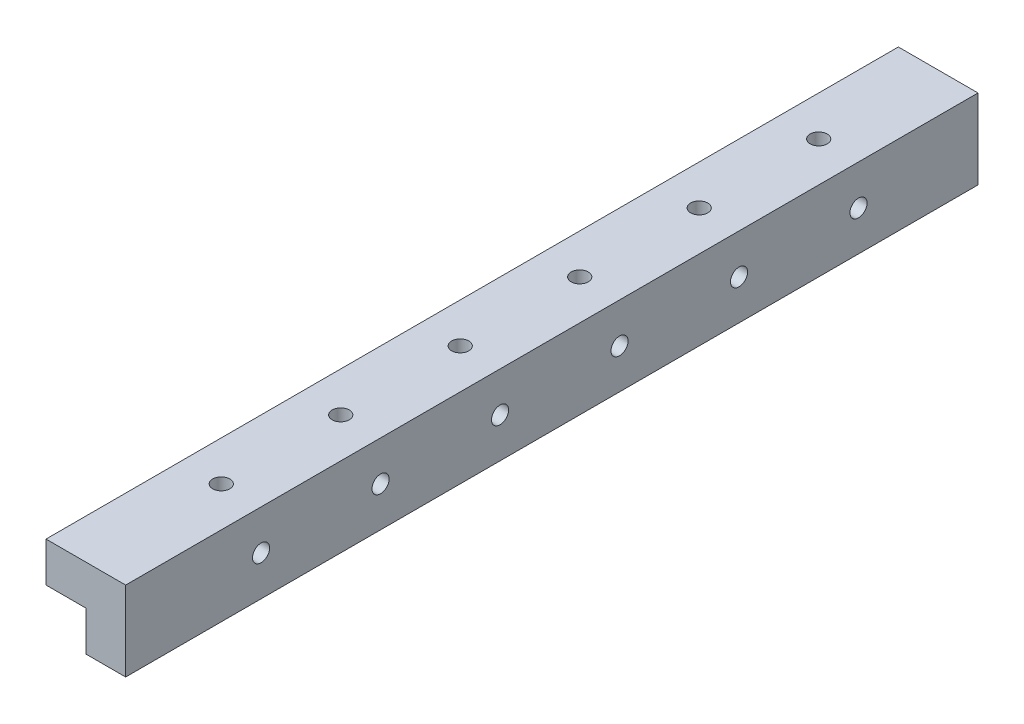
ISO-10303-21;
HEADER;
FILE_DESCRIPTION(('STEP AP214'),'2;1');
FILE_NAME('part.step','',(''),(''),'','','');
FILE_SCHEMA(('AUTOMOTIVE_DESIGN { 1 0 10303 214 1 1 1 1 }'));
ENDSEC;
DATA;
#1=APPLICATION_CONTEXT('core data for automotive mechanical design processes');
#2=APPLICATION_PROTOCOL_DEFINITION('international standard','automotive_design',2000,#1);
#3=PRODUCT_CONTEXT('',#1,'mechanical');
#4=PRODUCT('Part','Part','',(#3));
#5=PRODUCT_RELATED_PRODUCT_CATEGORY('part','',(#4));
#6=PRODUCT_DEFINITION_FORMATION('','',#4);
#7=PRODUCT_DEFINITION_CONTEXT('part definition',#1,'design');
#8=PRODUCT_DEFINITION('design','',#6,#7);
#9=PRODUCT_DEFINITION_SHAPE('','',#8);
#10=(LENGTH_UNIT() NAMED_UNIT(*) SI_UNIT(.MILLI.,.METRE.));
#11=(NAMED_UNIT(*) PLANE_ANGLE_UNIT() SI_UNIT($,.RADIAN.));
#12=(NAMED_UNIT(*) SI_UNIT($,.STERADIAN.) SOLID_ANGLE_UNIT());
#13=UNCERTAINTY_MEASURE_WITH_UNIT(LENGTH_MEASURE(1.E-05),#10,'distance_accuracy_value','');
#14=(GEOMETRIC_REPRESENTATION_CONTEXT(3) GLOBAL_UNCERTAINTY_ASSIGNED_CONTEXT((#13)) GLOBAL_UNIT_ASSIGNED_CONTEXT((#10,
#11,#12)) REPRESENTATION_CONTEXT('',''));
#15=CARTESIAN_POINT('',(0.,0.,0.));
#16=DIRECTION('',(0.,0.,1.));
#17=DIRECTION('',(1.,0.,0.));
#18=AXIS2_PLACEMENT_3D('',#15,#16,#17);
#19=CARTESIAN_POINT('',(0.,0.,-214.));
#20=DIRECTION('',(-1.,0.,0.));
#21=DIRECTION('',(0.,-1.,0.));
#22=AXIS2_PLACEMENT_3D('',#19,#20,#21);
#23=PLANE('',#22);
#24=DIRECTION('',(0.,-1.,0.));
#25=VECTOR('',#24,1.);
#26=CARTESIAN_POINT('',(0.,0.,0.));
#27=LINE('',#26,#25);
#28=CARTESIAN_POINT('',(0.,0.,0.));
#29=VERTEX_POINT('',#28);
#30=CARTESIAN_POINT('',(0.,-10.0000000000002,0.));
#31=VERTEX_POINT('',#30);
#32=EDGE_CURVE('E117',#29,#31,#27,.T.);
#33=ORIENTED_EDGE('',*,*,#32,.F.);
#34=DIRECTION('',(0.,0.,1.));
#35=VECTOR('',#34,1.);
#36=CARTESIAN_POINT('',(0.,0.,-214.));
#37=LINE('',#36,#35);
#38=CARTESIAN_POINT('',(0.,0.,-214.));
#39=VERTEX_POINT('',#38);
#40=EDGE_CURVE('E11',#39,#29,#37,.T.);
#41=ORIENTED_EDGE('',*,*,#40,.F.);
#42=DIRECTION('',(0.,-1.,0.));
#43=VECTOR('',#42,1.);
#44=CARTESIAN_POINT('',(0.,0.,-214.));
#45=LINE('',#44,#43);
#46=CARTESIAN_POINT('',(0.,-10.0000000000002,-214.));
#47=VERTEX_POINT('',#46);
#48=EDGE_CURVE('E132',#39,#47,#45,.T.);
#49=ORIENTED_EDGE('',*,*,#48,.T.);
#50=DIRECTION('',(0.,0.,1.));
#51=VECTOR('',#50,1.);
#52=CARTESIAN_POINT('',(0.,-10.0000000000002,-214.));
#53=LINE('',#52,#51);
#54=EDGE_CURVE('E35',#47,#31,#53,.T.);
#55=ORIENTED_EDGE('',*,*,#54,.T.);
#56=EDGE_LOOP('',(#33,#41,#49,#55));
#57=FACE_BOUND('',#56,.T.);
#58=ADVANCED_FACE('F32',(#57),#23,.T.);
#59=CARTESIAN_POINT('',(-9.99999999999994,0.,-214.));
#60=DIRECTION('',(0.,-1.,0.));
#61=DIRECTION('',(0.,0.,-1.));
#62=AXIS2_PLACEMENT_3D('',#59,#60,#61);
#63=PLANE('',#62);
#64=DIRECTION('',(1.,0.,0.));
#65=VECTOR('',#64,1.);
#66=CARTESIAN_POINT('',(-9.99999999999994,0.,0.));
#67=LINE('',#66,#65);
#68=CARTESIAN_POINT('',(-9.99999999999994,0.,0.));
#69=VERTEX_POINT('',#68);
#70=EDGE_CURVE('E130',#69,#29,#67,.T.);
#71=ORIENTED_EDGE('',*,*,#70,.F.);
#72=DIRECTION('',(0.,0.,1.));
#73=VECTOR('',#72,1.);
#74=CARTESIAN_POINT('',(-9.99999999999994,0.,-214.));
#75=LINE('',#74,#73);
#76=CARTESIAN_POINT('',(-9.99999999999994,0.,-214.));
#77=VERTEX_POINT('',#76);
#78=EDGE_CURVE('E41',#77,#69,#75,.T.);
#79=ORIENTED_EDGE('',*,*,#78,.F.);
#80=DIRECTION('',(1.,0.,0.));
#81=VECTOR('',#80,1.);
#82=CARTESIAN_POINT('',(-9.99999999999994,0.,-214.));
#83=LINE('',#82,#81);
#84=EDGE_CURVE('E107',#77,#39,#83,.T.);
#85=ORIENTED_EDGE('',*,*,#84,.T.);
#86=ORIENTED_EDGE('',*,*,#40,.T.);
#87=EDGE_LOOP('',(#71,#79,#85,#86));
#88=FACE_BOUND('',#87,.T.);
#89=ADVANCED_FACE('F140',(#88),#63,.T.);
#90=CARTESIAN_POINT('',(-9.99999999999994,9.99999999999976,-214.));
#91=DIRECTION('',(-1.,0.,0.));
#92=DIRECTION('',(0.,-1.,0.));
#93=AXIS2_PLACEMENT_3D('',#90,#91,#92);
#94=PLANE('',#93);
#95=DIRECTION('',(0.,-1.,0.));
#96=VECTOR('',#95,1.);
#97=CARTESIAN_POINT('',(-9.99999999999994,9.99999999999976,0.));
#98=LINE('',#97,#96);
#99=CARTESIAN_POINT('',(-9.99999999999994,9.99999999999976,0.));
#100=VERTEX_POINT('',#99);
#101=EDGE_CURVE('E94',#100,#69,#98,.T.);
#102=ORIENTED_EDGE('',*,*,#101,.F.);
#103=DIRECTION('',(0.,0.,1.));
#104=VECTOR('',#103,1.);
#105=CARTESIAN_POINT('',(-9.99999999999994,9.99999999999976,-214.));
#106=LINE('',#105,#104);
#107=CARTESIAN_POINT('',(-9.99999999999994,9.99999999999976,-214.));
#108=VERTEX_POINT('',#107);
#109=EDGE_CURVE('E89',#108,#100,#106,.T.);
#110=ORIENTED_EDGE('',*,*,#109,.F.);
#111=DIRECTION('',(0.,-1.,0.));
#112=VECTOR('',#111,1.);
#113=CARTESIAN_POINT('',(-9.99999999999994,9.99999999999976,-214.));
#114=LINE('',#113,#112);
#115=EDGE_CURVE('E92',#108,#77,#114,.T.);
#116=ORIENTED_EDGE('',*,*,#115,.T.);
#117=ORIENTED_EDGE('',*,*,#78,.T.);
#118=EDGE_LOOP('',(#102,#110,#116,#117));
#119=FACE_BOUND('',#118,.T.);
#120=ADVANCED_FACE('F91',(#119),#94,.T.);
#121=CARTESIAN_POINT('',(10.0000000000001,9.99999999999976,-214.));
#122=DIRECTION('',(0.,1.,0.));
#123=DIRECTION('',(-1.,0.,0.));
#124=AXIS2_PLACEMENT_3D('',#121,#122,#123);
#125=PLANE('',#124);
#126=CARTESIAN_POINT('',(-2.12677098154757E-12,9.99999999999976,-34.0000000000001));
#127=DIRECTION('',(0.,1.,0.));
#128=DIRECTION('',(0.,0.,1.));
#129=AXIS2_PLACEMENT_3D('',#126,#127,#128);
#130=CIRCLE('',#129,2.14999999999999);
#131=CARTESIAN_POINT('',(-2.12677098154757E-12,9.99999999999976,-31.8500000000001));
#132=VERTEX_POINT('',#131);
#133=EDGE_CURVE('E268',#132,#132,#130,.T.);
#134=ORIENTED_EDGE('',*,*,#133,.F.);
#135=EDGE_LOOP('',(#134));
#136=FACE_BOUND('',#135,.T.);
#137=CARTESIAN_POINT('',(-2.12677098154757E-12,9.99999999999976,-64.0000000000001));
#138=DIRECTION('',(0.,1.,0.));
#139=DIRECTION('',(0.,0.,1.));
#140=AXIS2_PLACEMENT_3D('',#137,#138,#139);
#141=CIRCLE('',#140,2.14999999999999);
#142=CARTESIAN_POINT('',(-2.12677098154757E-12,9.99999999999976,-61.8500000000001));
#143=VERTEX_POINT('',#142);
#144=EDGE_CURVE('E270',#143,#143,#141,.T.);
#145=ORIENTED_EDGE('',*,*,#144,.F.);
#146=EDGE_LOOP('',(#145));
#147=FACE_BOUND('',#146,.T.);
#148=CARTESIAN_POINT('',(-2.12677098154757E-12,9.99999999999976,-94.0000000000001));
#149=DIRECTION('',(0.,1.,0.));
#150=DIRECTION('',(0.,0.,1.));
#151=AXIS2_PLACEMENT_3D('',#148,#149,#150);
#152=CIRCLE('',#151,2.14999999999999);
#153=CARTESIAN_POINT('',(-2.12677098154757E-12,9.99999999999976,-91.8500000000001));
#154=VERTEX_POINT('',#153);
#155=EDGE_CURVE('E278',#154,#154,#152,.T.);
#156=ORIENTED_EDGE('',*,*,#155,.F.);
#157=EDGE_LOOP('',(#156));
#158=FACE_BOUND('',#157,.T.);
#159=CARTESIAN_POINT('',(-2.12677098154757E-12,9.99999999999976,-124.));
#160=DIRECTION('',(0.,1.,0.));
#161=DIRECTION('',(0.,0.,1.));
#162=AXIS2_PLACEMENT_3D('',#159,#160,#161);
#163=CIRCLE('',#162,2.14999999999999);
#164=CARTESIAN_POINT('',(-2.12677098154757E-12,9.99999999999976,-121.85));
#165=VERTEX_POINT('',#164);
#166=EDGE_CURVE('E284',#165,#165,#163,.T.);
#167=ORIENTED_EDGE('',*,*,#166,.F.);
#168=EDGE_LOOP('',(#167));
#169=FACE_BOUND('',#168,.T.);
#170=CARTESIAN_POINT('',(-2.12677098154757E-12,9.99999999999976,-154.));
#171=DIRECTION('',(0.,1.,0.));
#172=DIRECTION('',(0.,0.,1.));
#173=AXIS2_PLACEMENT_3D('',#170,#171,#172);
#174=CIRCLE('',#173,2.14999999999999);
#175=CARTESIAN_POINT('',(-2.12677098154757E-12,9.99999999999976,-151.85));
#176=VERTEX_POINT('',#175);
#177=EDGE_CURVE('E290',#176,#176,#174,.T.);
#178=ORIENTED_EDGE('',*,*,#177,.F.);
#179=EDGE_LOOP('',(#178));
#180=FACE_BOUND('',#179,.T.);
#181=CARTESIAN_POINT('',(-2.12677098154757E-12,9.99999999999976,-184.));
#182=DIRECTION('',(0.,1.,0.));
#183=DIRECTION('',(0.,0.,1.));
#184=AXIS2_PLACEMENT_3D('',#181,#182,#183);
#185=CIRCLE('',#184,2.14999999999999);
#186=CARTESIAN_POINT('',(-2.12677098154757E-12,9.99999999999976,-181.85));
#187=VERTEX_POINT('',#186);
#188=EDGE_CURVE('E296',#187,#187,#185,.T.);
#189=ORIENTED_EDGE('',*,*,#188,.F.);
#190=EDGE_LOOP('',(#189));
#191=FACE_BOUND('',#190,.T.);
#192=DIRECTION('',(-1.,0.,0.));
#193=VECTOR('',#192,1.);
#194=CARTESIAN_POINT('',(10.0000000000001,9.99999999999976,0.));
#195=LINE('',#194,#193);
#196=CARTESIAN_POINT('',(10.0000000000001,9.99999999999976,0.));
#197=VERTEX_POINT('',#196);
#198=EDGE_CURVE('E127',#197,#100,#195,.T.);
#199=ORIENTED_EDGE('',*,*,#198,.F.);
#200=DIRECTION('',(0.,0.,1.));
#201=VECTOR('',#200,1.);
#202=CARTESIAN_POINT('',(10.0000000000001,9.99999999999976,-214.));
#203=LINE('',#202,#201);
#204=CARTESIAN_POINT('',(10.0000000000001,9.99999999999976,-214.));
#205=VERTEX_POINT('',#204);
#206=EDGE_CURVE('E99',#205,#197,#203,.T.);
#207=ORIENTED_EDGE('',*,*,#206,.F.);
#208=DIRECTION('',(-1.,0.,0.));
#209=VECTOR('',#208,1.);
#210=CARTESIAN_POINT('',(10.0000000000001,9.99999999999976,-214.));
#211=LINE('',#210,#209);
#212=EDGE_CURVE('E105',#205,#108,#211,.T.);
#213=ORIENTED_EDGE('',*,*,#212,.T.);
#214=ORIENTED_EDGE('',*,*,#109,.T.);
#215=EDGE_LOOP('',(#199,#207,#213,#214));
#216=FACE_BOUND('',#215,.T.);
#217=ADVANCED_FACE('F109',(#136,#147,#158,#169,#180,#191,#216),#125,.T.);
#218=CARTESIAN_POINT('',(10.0000000000001,-10.0000000000002,-214.));
#219=DIRECTION('',(1.,0.,0.));
#220=DIRECTION('',(0.,0.,-1.));
#221=AXIS2_PLACEMENT_3D('',#218,#219,#220);
#222=PLANE('',#221);
#223=CARTESIAN_POINT('',(10.0000000000001,-4.78147506740733E-12,-34.0000000000003));
#224=DIRECTION('',(1.,0.,0.));
#225=DIRECTION('',(0.,0.,-1.));
#226=AXIS2_PLACEMENT_3D('',#223,#224,#225);
#227=CIRCLE('',#226,2.14999999999999);
#228=CARTESIAN_POINT('',(10.0000000000001,-4.78147506740733E-12,-36.1500000000003));
#229=VERTEX_POINT('',#228);
#230=EDGE_CURVE('E302',#229,#229,#227,.T.);
#231=ORIENTED_EDGE('',*,*,#230,.F.);
#232=EDGE_LOOP('',(#231));
#233=FACE_BOUND('',#232,.T.);
#234=CARTESIAN_POINT('',(10.0000000000001,-4.4692248417315E-12,-64.0000000000003));
#235=DIRECTION('',(1.,0.,0.));
#236=DIRECTION('',(0.,0.,-1.));
#237=AXIS2_PLACEMENT_3D('',#234,#235,#236);
#238=CIRCLE('',#237,2.14999999999999);
#239=CARTESIAN_POINT('',(10.0000000000001,-4.4692248417315E-12,-66.1500000000003));
#240=VERTEX_POINT('',#239);
#241=EDGE_CURVE('E308',#240,#240,#238,.T.);
#242=ORIENTED_EDGE('',*,*,#241,.F.);
#243=EDGE_LOOP('',(#242));
#244=FACE_BOUND('',#243,.T.);
#245=CARTESIAN_POINT('',(10.0000000000001,-4.15697461605568E-12,-94.0000000000003));
#246=DIRECTION('',(1.,0.,0.));
#247=DIRECTION('',(0.,0.,-1.));
#248=AXIS2_PLACEMENT_3D('',#245,#246,#247);
#249=CIRCLE('',#248,2.14999999999999);
#250=CARTESIAN_POINT('',(10.0000000000001,-4.15697461605568E-12,-96.1500000000003));
#251=VERTEX_POINT('',#250);
#252=EDGE_CURVE('E314',#251,#251,#249,.T.);
#253=ORIENTED_EDGE('',*,*,#252,.F.);
#254=EDGE_LOOP('',(#253));
#255=FACE_BOUND('',#254,.T.);
#256=CARTESIAN_POINT('',(10.0000000000001,-3.84472439037985E-12,-124.));
#257=DIRECTION('',(1.,0.,0.));
#258=DIRECTION('',(0.,0.,-1.));
#259=AXIS2_PLACEMENT_3D('',#256,#257,#258);
#260=CIRCLE('',#259,2.14999999999999);
#261=CARTESIAN_POINT('',(10.0000000000001,-3.84472439037985E-12,-126.15));
#262=VERTEX_POINT('',#261);
#263=EDGE_CURVE('E320',#262,#262,#260,.T.);
#264=ORIENTED_EDGE('',*,*,#263,.F.);
#265=EDGE_LOOP('',(#264));
#266=FACE_BOUND('',#265,.T.);
#267=CARTESIAN_POINT('',(10.0000000000001,-3.53247416470402E-12,-154.));
#268=DIRECTION('',(1.,0.,0.));
#269=DIRECTION('',(0.,0.,-1.));
#270=AXIS2_PLACEMENT_3D('',#267,#268,#269);
#271=CIRCLE('',#270,2.14999999999999);
#272=CARTESIAN_POINT('',(10.0000000000001,-3.53247416470402E-12,-156.15));
#273=VERTEX_POINT('',#272);
#274=EDGE_CURVE('E326',#273,#273,#271,.T.);
#275=ORIENTED_EDGE('',*,*,#274,.F.);
#276=EDGE_LOOP('',(#275));
#277=FACE_BOUND('',#276,.T.);
#278=CARTESIAN_POINT('',(10.0000000000001,-3.2202239390282E-12,-184.));
#279=DIRECTION('',(1.,0.,0.));
#280=DIRECTION('',(0.,0.,-1.));
#281=AXIS2_PLACEMENT_3D('',#278,#279,#280);
#282=CIRCLE('',#281,2.14999999999999);
#283=CARTESIAN_POINT('',(10.0000000000001,-3.2202239390282E-12,-186.15));
#284=VERTEX_POINT('',#283);
#285=EDGE_CURVE('E332',#284,#284,#282,.T.);
#286=ORIENTED_EDGE('',*,*,#285,.F.);
#287=EDGE_LOOP('',(#286));
#288=FACE_BOUND('',#287,.T.);
#289=DIRECTION('',(0.,1.,0.));
#290=VECTOR('',#289,1.);
#291=CARTESIAN_POINT('',(10.0000000000001,-10.0000000000002,0.));
#292=LINE('',#291,#290);
#293=CARTESIAN_POINT('',(10.0000000000001,-10.0000000000002,0.));
#294=VERTEX_POINT('',#293);
#295=EDGE_CURVE('E124',#294,#197,#292,.T.);
#296=ORIENTED_EDGE('',*,*,#295,.F.);
#297=DIRECTION('',(0.,0.,1.));
#298=VECTOR('',#297,1.);
#299=CARTESIAN_POINT('',(10.0000000000001,-10.0000000000002,-214.));
#300=LINE('',#299,#298);
#301=CARTESIAN_POINT('',(10.0000000000001,-10.0000000000002,-214.));
#302=VERTEX_POINT('',#301);
#303=EDGE_CURVE('E135',#302,#294,#300,.T.);
#304=ORIENTED_EDGE('',*,*,#303,.F.);
#305=DIRECTION('',(0.,1.,0.));
#306=VECTOR('',#305,1.);
#307=CARTESIAN_POINT('',(10.0000000000001,-10.0000000000002,-214.));
#308=LINE('',#307,#306);
#309=EDGE_CURVE('E110',#302,#205,#308,.T.);
#310=ORIENTED_EDGE('',*,*,#309,.T.);
#311=ORIENTED_EDGE('',*,*,#206,.T.);
#312=EDGE_LOOP('',(#296,#304,#310,#311));
#313=FACE_BOUND('',#312,.T.);
#314=ADVANCED_FACE('F153',(#233,#244,#255,#266,#277,#288,#313),#222,.T.);
#315=CARTESIAN_POINT('',(0.,-10.0000000000002,-214.));
#316=DIRECTION('',(0.,-1.,0.));
#317=DIRECTION('',(0.,0.,-1.));
#318=AXIS2_PLACEMENT_3D('',#315,#316,#317);
#319=PLANE('',#318);
#320=DIRECTION('',(1.,0.,0.));
#321=VECTOR('',#320,1.);
#322=CARTESIAN_POINT('',(0.,-10.0000000000002,0.));
#323=LINE('',#322,#321);
#324=EDGE_CURVE('E120',#31,#294,#323,.T.);
#325=ORIENTED_EDGE('',*,*,#324,.F.);
#326=ORIENTED_EDGE('',*,*,#54,.F.);
#327=DIRECTION('',(1.,0.,0.));
#328=VECTOR('',#327,1.);
#329=CARTESIAN_POINT('',(0.,-10.0000000000002,-214.));
#330=LINE('',#329,#328);
#331=EDGE_CURVE('E112',#47,#302,#330,.T.);
#332=ORIENTED_EDGE('',*,*,#331,.T.);
#333=ORIENTED_EDGE('',*,*,#303,.T.);
#334=EDGE_LOOP('',(#325,#326,#332,#333));
#335=FACE_BOUND('',#334,.T.);
#336=ADVANCED_FACE('F137',(#335),#319,.T.);
#337=CARTESIAN_POINT('',(0.,0.,-214.));
#338=DIRECTION('',(0.,0.,1.));
#339=DIRECTION('',(1.,0.,0.));
#340=AXIS2_PLACEMENT_3D('',#337,#338,#339);
#341=PLANE('',#340);
#342=ORIENTED_EDGE('',*,*,#48,.F.);
#343=ORIENTED_EDGE('',*,*,#84,.F.);
#344=ORIENTED_EDGE('',*,*,#115,.F.);
#345=ORIENTED_EDGE('',*,*,#212,.F.);
#346=ORIENTED_EDGE('',*,*,#309,.F.);
#347=ORIENTED_EDGE('',*,*,#331,.F.);
#348=EDGE_LOOP('',(#342,#343,#344,#345,#346,#347));
#349=FACE_BOUND('',#348,.T.);
#350=ADVANCED_FACE('F103',(#349),#341,.F.);
#351=CARTESIAN_POINT('',(0.,0.,0.));
#352=DIRECTION('',(0.,0.,1.));
#353=DIRECTION('',(1.,0.,0.));
#354=AXIS2_PLACEMENT_3D('',#351,#352,#353);
#355=PLANE('',#354);
#356=ORIENTED_EDGE('',*,*,#32,.T.);
#357=ORIENTED_EDGE('',*,*,#324,.T.);
#358=ORIENTED_EDGE('',*,*,#295,.T.);
#359=ORIENTED_EDGE('',*,*,#198,.T.);
#360=ORIENTED_EDGE('',*,*,#101,.T.);
#361=ORIENTED_EDGE('',*,*,#70,.T.);
#362=EDGE_LOOP('',(#356,#357,#358,#359,#360,#361));
#363=FACE_BOUND('',#362,.T.);
#364=ADVANCED_FACE('F139',(#363),#355,.T.);
#365=CARTESIAN_POINT('',(3.17500000000007,-3.22195866250418E-12,-184.));
#366=DIRECTION('',(-1.,0.,0.));
#367=DIRECTION('',(0.,0.,1.));
#368=AXIS2_PLACEMENT_3D('',#365,#366,#367);
#369=PLANE('',#368);
#370=CARTESIAN_POINT('',(3.17500000000007,-3.2202239390282E-12,-184.));
#371=DIRECTION('',(1.,0.,0.));
#372=DIRECTION('',(0.,0.,-1.));
#373=AXIS2_PLACEMENT_3D('',#370,#371,#372);
#374=CIRCLE('',#373,2.15);
#375=CARTESIAN_POINT('',(3.17500000000007,-3.2202239390282E-12,-186.15));
#376=VERTEX_POINT('',#375);
#377=EDGE_CURVE('E121',#376,#376,#374,.T.);
#378=ORIENTED_EDGE('',*,*,#377,.T.);
#379=EDGE_LOOP('',(#378));
#380=FACE_BOUND('',#379,.T.);
#381=ADVANCED_FACE('F164',(#380),#369,.F.);
#382=CARTESIAN_POINT('',(10.0000000000001,-3.2202239390282E-12,-184.));
#383=DIRECTION('',(1.,0.,0.));
#384=DIRECTION('',(0.,0.,-1.));
#385=AXIS2_PLACEMENT_3D('',#382,#383,#384);
#386=CYLINDRICAL_SURFACE('',#385,2.14999999999999);
#387=ORIENTED_EDGE('',*,*,#377,.F.);
#388=EDGE_LOOP('',(#387));
#389=FACE_BOUND('',#388,.T.);
#390=ORIENTED_EDGE('',*,*,#285,.T.);
#391=EDGE_LOOP('',(#390));
#392=FACE_BOUND('',#391,.T.);
#393=ADVANCED_FACE('F168',(#389,#392),#386,.F.);
#394=CARTESIAN_POINT('',(3.17500000000007,-3.53420888818E-12,-154.));
#395=DIRECTION('',(-1.,0.,0.));
#396=DIRECTION('',(0.,0.,1.));
#397=AXIS2_PLACEMENT_3D('',#394,#395,#396);
#398=PLANE('',#397);
#399=CARTESIAN_POINT('',(3.17500000000007,-3.53247416470402E-12,-154.));
#400=DIRECTION('',(1.,0.,0.));
#401=DIRECTION('',(0.,0.,-1.));
#402=AXIS2_PLACEMENT_3D('',#399,#400,#401);
#403=CIRCLE('',#402,2.15);
#404=CARTESIAN_POINT('',(3.17500000000007,-3.53247416470402E-12,-156.15));
#405=VERTEX_POINT('',#404);
#406=EDGE_CURVE('E329',#405,#405,#403,.T.);
#407=ORIENTED_EDGE('',*,*,#406,.T.);
#408=EDGE_LOOP('',(#407));
#409=FACE_BOUND('',#408,.T.);
#410=ADVANCED_FACE('F172',(#409),#398,.F.);
#411=CARTESIAN_POINT('',(10.0000000000001,-3.53247416470402E-12,-154.));
#412=DIRECTION('',(1.,0.,0.));
#413=DIRECTION('',(0.,0.,-1.));
#414=AXIS2_PLACEMENT_3D('',#411,#412,#413);
#415=CYLINDRICAL_SURFACE('',#414,2.14999999999999);
#416=ORIENTED_EDGE('',*,*,#406,.F.);
#417=EDGE_LOOP('',(#416));
#418=FACE_BOUND('',#417,.T.);
#419=ORIENTED_EDGE('',*,*,#274,.T.);
#420=EDGE_LOOP('',(#419));
#421=FACE_BOUND('',#420,.T.);
#422=ADVANCED_FACE('F176',(#418,#421),#415,.F.);
#423=CARTESIAN_POINT('',(3.17500000000007,-3.84645911385583E-12,-124.));
#424=DIRECTION('',(-1.,0.,0.));
#425=DIRECTION('',(0.,0.,1.));
#426=AXIS2_PLACEMENT_3D('',#423,#424,#425);
#427=PLANE('',#426);
#428=CARTESIAN_POINT('',(3.17500000000007,-3.84472439037985E-12,-124.));
#429=DIRECTION('',(1.,0.,0.));
#430=DIRECTION('',(0.,0.,-1.));
#431=AXIS2_PLACEMENT_3D('',#428,#429,#430);
#432=CIRCLE('',#431,2.15);
#433=CARTESIAN_POINT('',(3.17500000000007,-3.84472439037985E-12,-126.15));
#434=VERTEX_POINT('',#433);
#435=EDGE_CURVE('E323',#434,#434,#432,.T.);
#436=ORIENTED_EDGE('',*,*,#435,.T.);
#437=EDGE_LOOP('',(#436));
#438=FACE_BOUND('',#437,.T.);
#439=ADVANCED_FACE('F180',(#438),#427,.F.);
#440=CARTESIAN_POINT('',(10.0000000000001,-3.84472439037985E-12,-124.));
#441=DIRECTION('',(1.,0.,0.));
#442=DIRECTION('',(0.,0.,-1.));
#443=AXIS2_PLACEMENT_3D('',#440,#441,#442);
#444=CYLINDRICAL_SURFACE('',#443,2.14999999999999);
#445=ORIENTED_EDGE('',*,*,#435,.F.);
#446=EDGE_LOOP('',(#445));
#447=FACE_BOUND('',#446,.T.);
#448=ORIENTED_EDGE('',*,*,#263,.T.);
#449=EDGE_LOOP('',(#448));
#450=FACE_BOUND('',#449,.T.);
#451=ADVANCED_FACE('F184',(#447,#450),#444,.F.);
#452=CARTESIAN_POINT('',(3.17500000000007,-4.15870933953165E-12,-94.0000000000003));
#453=DIRECTION('',(-1.,0.,0.));
#454=DIRECTION('',(0.,0.,1.));
#455=AXIS2_PLACEMENT_3D('',#452,#453,#454);
#456=PLANE('',#455);
#457=CARTESIAN_POINT('',(3.17500000000007,-4.15697461605568E-12,-94.0000000000003));
#458=DIRECTION('',(1.,0.,0.));
#459=DIRECTION('',(0.,0.,-1.));
#460=AXIS2_PLACEMENT_3D('',#457,#458,#459);
#461=CIRCLE('',#460,2.15);
#462=CARTESIAN_POINT('',(3.17500000000007,-4.15697461605568E-12,-96.1500000000003));
#463=VERTEX_POINT('',#462);
#464=EDGE_CURVE('E317',#463,#463,#461,.T.);
#465=ORIENTED_EDGE('',*,*,#464,.T.);
#466=EDGE_LOOP('',(#465));
#467=FACE_BOUND('',#466,.T.);
#468=ADVANCED_FACE('F188',(#467),#456,.F.);
#469=CARTESIAN_POINT('',(10.0000000000001,-4.15697461605568E-12,-94.0000000000003));
#470=DIRECTION('',(1.,0.,0.));
#471=DIRECTION('',(0.,0.,-1.));
#472=AXIS2_PLACEMENT_3D('',#469,#470,#471);
#473=CYLINDRICAL_SURFACE('',#472,2.14999999999999);
#474=ORIENTED_EDGE('',*,*,#464,.F.);
#475=EDGE_LOOP('',(#474));
#476=FACE_BOUND('',#475,.T.);
#477=ORIENTED_EDGE('',*,*,#252,.T.);
#478=EDGE_LOOP('',(#477));
#479=FACE_BOUND('',#478,.T.);
#480=ADVANCED_FACE('F192',(#476,#479),#473,.F.);
#481=CARTESIAN_POINT('',(3.17500000000007,-4.47095956520748E-12,-64.0000000000003));
#482=DIRECTION('',(-1.,0.,0.));
#483=DIRECTION('',(0.,0.,1.));
#484=AXIS2_PLACEMENT_3D('',#481,#482,#483);
#485=PLANE('',#484);
#486=CARTESIAN_POINT('',(3.17500000000007,-4.4692248417315E-12,-64.0000000000003));
#487=DIRECTION('',(1.,0.,0.));
#488=DIRECTION('',(0.,0.,-1.));
#489=AXIS2_PLACEMENT_3D('',#486,#487,#488);
#490=CIRCLE('',#489,2.15);
#491=CARTESIAN_POINT('',(3.17500000000007,-4.4692248417315E-12,-66.1500000000003));
#492=VERTEX_POINT('',#491);
#493=EDGE_CURVE('E311',#492,#492,#490,.T.);
#494=ORIENTED_EDGE('',*,*,#493,.T.);
#495=EDGE_LOOP('',(#494));
#496=FACE_BOUND('',#495,.T.);
#497=ADVANCED_FACE('F196',(#496),#485,.F.);
#498=CARTESIAN_POINT('',(10.0000000000001,-4.4692248417315E-12,-64.0000000000003));
#499=DIRECTION('',(1.,0.,0.));
#500=DIRECTION('',(0.,0.,-1.));
#501=AXIS2_PLACEMENT_3D('',#498,#499,#500);
#502=CYLINDRICAL_SURFACE('',#501,2.14999999999999);
#503=ORIENTED_EDGE('',*,*,#493,.F.);
#504=EDGE_LOOP('',(#503));
#505=FACE_BOUND('',#504,.T.);
#506=ORIENTED_EDGE('',*,*,#241,.T.);
#507=EDGE_LOOP('',(#506));
#508=FACE_BOUND('',#507,.T.);
#509=ADVANCED_FACE('F200',(#505,#508),#502,.F.);
#510=CARTESIAN_POINT('',(3.17500000000007,-4.7832097908833E-12,-34.0000000000003));
#511=DIRECTION('',(-1.,0.,0.));
#512=DIRECTION('',(0.,0.,1.));
#513=AXIS2_PLACEMENT_3D('',#510,#511,#512);
#514=PLANE('',#513);
#515=CARTESIAN_POINT('',(3.17500000000007,-4.78147506740733E-12,-34.0000000000003));
#516=DIRECTION('',(1.,0.,0.));
#517=DIRECTION('',(0.,0.,-1.));
#518=AXIS2_PLACEMENT_3D('',#515,#516,#517);
#519=CIRCLE('',#518,2.15);
#520=CARTESIAN_POINT('',(3.17500000000007,-4.78147506740733E-12,-36.1500000000003));
#521=VERTEX_POINT('',#520);
#522=EDGE_CURVE('E305',#521,#521,#519,.T.);
#523=ORIENTED_EDGE('',*,*,#522,.T.);
#524=EDGE_LOOP('',(#523));
#525=FACE_BOUND('',#524,.T.);
#526=ADVANCED_FACE('F204',(#525),#514,.F.);
#527=CARTESIAN_POINT('',(10.0000000000001,-4.78147506740733E-12,-34.0000000000003));
#528=DIRECTION('',(1.,0.,0.));
#529=DIRECTION('',(0.,0.,-1.));
#530=AXIS2_PLACEMENT_3D('',#527,#528,#529);
#531=CYLINDRICAL_SURFACE('',#530,2.14999999999999);
#532=ORIENTED_EDGE('',*,*,#522,.F.);
#533=EDGE_LOOP('',(#532));
#534=FACE_BOUND('',#533,.T.);
#535=ORIENTED_EDGE('',*,*,#230,.T.);
#536=EDGE_LOOP('',(#535));
#537=FACE_BOUND('',#536,.T.);
#538=ADVANCED_FACE('F208',(#534,#537),#531,.F.);
#539=CARTESIAN_POINT('',(-2.12850570502354E-12,3.17499999999976,-184.));
#540=DIRECTION('',(0.,-1.,0.));
#541=DIRECTION('',(0.,0.,-1.));
#542=AXIS2_PLACEMENT_3D('',#539,#540,#541);
#543=PLANE('',#542);
#544=CARTESIAN_POINT('',(-2.12677098154757E-12,3.17499999999976,-184.));
#545=DIRECTION('',(0.,1.,0.));
#546=DIRECTION('',(0.,0.,1.));
#547=AXIS2_PLACEMENT_3D('',#544,#545,#546);
#548=CIRCLE('',#547,2.15);
#549=CARTESIAN_POINT('',(-2.12677098154757E-12,3.17499999999976,-181.85));
#550=VERTEX_POINT('',#549);
#551=EDGE_CURVE('E299',#550,#550,#548,.T.);
#552=ORIENTED_EDGE('',*,*,#551,.T.);
#553=EDGE_LOOP('',(#552));
#554=FACE_BOUND('',#553,.T.);
#555=ADVANCED_FACE('F212',(#554),#543,.F.);
#556=CARTESIAN_POINT('',(-2.12677098154757E-12,9.99999999999976,-184.));
#557=DIRECTION('',(0.,1.,0.));
#558=DIRECTION('',(0.,0.,1.));
#559=AXIS2_PLACEMENT_3D('',#556,#557,#558);
#560=CYLINDRICAL_SURFACE('',#559,2.14999999999999);
#561=ORIENTED_EDGE('',*,*,#551,.F.);
#562=EDGE_LOOP('',(#561));
#563=FACE_BOUND('',#562,.T.);
#564=ORIENTED_EDGE('',*,*,#188,.T.);
#565=EDGE_LOOP('',(#564));
#566=FACE_BOUND('',#565,.T.);
#567=ADVANCED_FACE('F216',(#563,#566),#560,.F.);
#568=CARTESIAN_POINT('',(-2.12850570502354E-12,3.17499999999976,-154.));
#569=DIRECTION('',(0.,-1.,0.));
#570=DIRECTION('',(0.,0.,-1.));
#571=AXIS2_PLACEMENT_3D('',#568,#569,#570);
#572=PLANE('',#571);
#573=CARTESIAN_POINT('',(-2.12677098154757E-12,3.17499999999976,-154.));
#574=DIRECTION('',(0.,1.,0.));
#575=DIRECTION('',(0.,0.,1.));
#576=AXIS2_PLACEMENT_3D('',#573,#574,#575);
#577=CIRCLE('',#576,2.15);
#578=CARTESIAN_POINT('',(-2.12677098154757E-12,3.17499999999976,-151.85));
#579=VERTEX_POINT('',#578);
#580=EDGE_CURVE('E293',#579,#579,#577,.T.);
#581=ORIENTED_EDGE('',*,*,#580,.T.);
#582=EDGE_LOOP('',(#581));
#583=FACE_BOUND('',#582,.T.);
#584=ADVANCED_FACE('F220',(#583),#572,.F.);
#585=CARTESIAN_POINT('',(-2.12677098154757E-12,9.99999999999976,-154.));
#586=DIRECTION('',(0.,1.,0.));
#587=DIRECTION('',(0.,0.,1.));
#588=AXIS2_PLACEMENT_3D('',#585,#586,#587);
#589=CYLINDRICAL_SURFACE('',#588,2.14999999999999);
#590=ORIENTED_EDGE('',*,*,#580,.F.);
#591=EDGE_LOOP('',(#590));
#592=FACE_BOUND('',#591,.T.);
#593=ORIENTED_EDGE('',*,*,#177,.T.);
#594=EDGE_LOOP('',(#593));
#595=FACE_BOUND('',#594,.T.);
#596=ADVANCED_FACE('F224',(#592,#595),#589,.F.);
#597=CARTESIAN_POINT('',(-2.12850570502354E-12,3.17499999999976,-124.));
#598=DIRECTION('',(0.,-1.,0.));
#599=DIRECTION('',(0.,0.,-1.));
#600=AXIS2_PLACEMENT_3D('',#597,#598,#599);
#601=PLANE('',#600);
#602=CARTESIAN_POINT('',(-2.12677098154757E-12,3.17499999999976,-124.));
#603=DIRECTION('',(0.,1.,0.));
#604=DIRECTION('',(0.,0.,1.));
#605=AXIS2_PLACEMENT_3D('',#602,#603,#604);
#606=CIRCLE('',#605,2.15);
#607=CARTESIAN_POINT('',(-2.12677098154757E-12,3.17499999999976,-121.85));
#608=VERTEX_POINT('',#607);
#609=EDGE_CURVE('E287',#608,#608,#606,.T.);
#610=ORIENTED_EDGE('',*,*,#609,.T.);
#611=EDGE_LOOP('',(#610));
#612=FACE_BOUND('',#611,.T.);
#613=ADVANCED_FACE('F228',(#612),#601,.F.);
#614=CARTESIAN_POINT('',(-2.12677098154757E-12,9.99999999999976,-124.));
#615=DIRECTION('',(0.,1.,0.));
#616=DIRECTION('',(0.,0.,1.));
#617=AXIS2_PLACEMENT_3D('',#614,#615,#616);
#618=CYLINDRICAL_SURFACE('',#617,2.14999999999999);
#619=ORIENTED_EDGE('',*,*,#609,.F.);
#620=EDGE_LOOP('',(#619));
#621=FACE_BOUND('',#620,.T.);
#622=ORIENTED_EDGE('',*,*,#166,.T.);
#623=EDGE_LOOP('',(#622));
#624=FACE_BOUND('',#623,.T.);
#625=ADVANCED_FACE('F232',(#621,#624),#618,.F.);
#626=CARTESIAN_POINT('',(-2.12850570502354E-12,3.17499999999976,-94.0000000000001));
#627=DIRECTION('',(0.,-1.,0.));
#628=DIRECTION('',(0.,0.,-1.));
#629=AXIS2_PLACEMENT_3D('',#626,#627,#628);
#630=PLANE('',#629);
#631=CARTESIAN_POINT('',(-2.12677098154757E-12,3.17499999999976,-94.0000000000001));
#632=DIRECTION('',(0.,1.,0.));
#633=DIRECTION('',(0.,0.,1.));
#634=AXIS2_PLACEMENT_3D('',#631,#632,#633);
#635=CIRCLE('',#634,2.15);
#636=CARTESIAN_POINT('',(-2.12677098154757E-12,3.17499999999976,-91.8500000000001));
#637=VERTEX_POINT('',#636);
#638=EDGE_CURVE('E281',#637,#637,#635,.T.);
#639=ORIENTED_EDGE('',*,*,#638,.T.);
#640=EDGE_LOOP('',(#639));
#641=FACE_BOUND('',#640,.T.);
#642=ADVANCED_FACE('F236',(#641),#630,.F.);
#643=CARTESIAN_POINT('',(-2.12677098154757E-12,9.99999999999976,-94.0000000000001));
#644=DIRECTION('',(0.,1.,0.));
#645=DIRECTION('',(0.,0.,1.));
#646=AXIS2_PLACEMENT_3D('',#643,#644,#645);
#647=CYLINDRICAL_SURFACE('',#646,2.14999999999999);
#648=ORIENTED_EDGE('',*,*,#638,.F.);
#649=EDGE_LOOP('',(#648));
#650=FACE_BOUND('',#649,.T.);
#651=ORIENTED_EDGE('',*,*,#155,.T.);
#652=EDGE_LOOP('',(#651));
#653=FACE_BOUND('',#652,.T.);
#654=ADVANCED_FACE('F240',(#650,#653),#647,.F.);
#655=CARTESIAN_POINT('',(-2.12850570502354E-12,3.17499999999976,-64.0000000000001));
#656=DIRECTION('',(0.,-1.,0.));
#657=DIRECTION('',(0.,0.,-1.));
#658=AXIS2_PLACEMENT_3D('',#655,#656,#657);
#659=PLANE('',#658);
#660=CARTESIAN_POINT('',(-2.12677098154757E-12,3.17499999999976,-64.0000000000001));
#661=DIRECTION('',(0.,1.,0.));
#662=DIRECTION('',(0.,0.,1.));
#663=AXIS2_PLACEMENT_3D('',#660,#661,#662);
#664=CIRCLE('',#663,2.15);
#665=CARTESIAN_POINT('',(-2.12677098154757E-12,3.17499999999976,-61.8500000000001));
#666=VERTEX_POINT('',#665);
#667=EDGE_CURVE('E275',#666,#666,#664,.T.);
#668=ORIENTED_EDGE('',*,*,#667,.T.);
#669=EDGE_LOOP('',(#668));
#670=FACE_BOUND('',#669,.T.);
#671=ADVANCED_FACE('F244',(#670),#659,.F.);
#672=CARTESIAN_POINT('',(-2.12677098154757E-12,9.99999999999976,-64.0000000000001));
#673=DIRECTION('',(0.,1.,0.));
#674=DIRECTION('',(0.,0.,1.));
#675=AXIS2_PLACEMENT_3D('',#672,#673,#674);
#676=CYLINDRICAL_SURFACE('',#675,2.14999999999999);
#677=ORIENTED_EDGE('',*,*,#667,.F.);
#678=EDGE_LOOP('',(#677));
#679=FACE_BOUND('',#678,.T.);
#680=ORIENTED_EDGE('',*,*,#144,.T.);
#681=EDGE_LOOP('',(#680));
#682=FACE_BOUND('',#681,.T.);
#683=ADVANCED_FACE('F248',(#679,#682),#676,.F.);
#684=CARTESIAN_POINT('',(-2.12850570502354E-12,3.17499999999976,-34.0000000000001));
#685=DIRECTION('',(0.,-1.,0.));
#686=DIRECTION('',(0.,0.,-1.));
#687=AXIS2_PLACEMENT_3D('',#684,#685,#686);
#688=PLANE('',#687);
#689=CARTESIAN_POINT('',(-2.12677098154757E-12,3.17499999999976,-34.0000000000001));
#690=DIRECTION('',(0.,1.,0.));
#691=DIRECTION('',(0.,0.,1.));
#692=AXIS2_PLACEMENT_3D('',#689,#690,#691);
#693=CIRCLE('',#692,2.15);
#694=CARTESIAN_POINT('',(-2.12677098154757E-12,3.17499999999976,-31.8500000000001));
#695=VERTEX_POINT('',#694);
#696=EDGE_CURVE('E265',#695,#695,#693,.T.);
#697=ORIENTED_EDGE('',*,*,#696,.T.);
#698=EDGE_LOOP('',(#697));
#699=FACE_BOUND('',#698,.T.);
#700=ADVANCED_FACE('F252',(#699),#688,.F.);
#701=CARTESIAN_POINT('',(-2.12677098154757E-12,9.99999999999976,-34.0000000000001));
#702=DIRECTION('',(0.,1.,0.));
#703=DIRECTION('',(0.,0.,1.));
#704=AXIS2_PLACEMENT_3D('',#701,#702,#703);
#705=CYLINDRICAL_SURFACE('',#704,2.14999999999999);
#706=ORIENTED_EDGE('',*,*,#696,.F.);
#707=EDGE_LOOP('',(#706));
#708=FACE_BOUND('',#707,.T.);
#709=ORIENTED_EDGE('',*,*,#133,.T.);
#710=EDGE_LOOP('',(#709));
#711=FACE_BOUND('',#710,.T.);
#712=ADVANCED_FACE('F256',(#708,#711),#705,.F.);
#713=CLOSED_SHELL('',(#58,#89,#120,#217,#314,#336,#350,#364,#381,#393,#410,#422,#439,#451,#468,
#480,#497,#509,#526,#538,#555,#567,#584,#596,#613,#625,#642,#654,#671,#683,#700,#712));
#714=MANIFOLD_SOLID_BREP('B2',#713);
#715=ADVANCED_BREP_SHAPE_REPRESENTATION('',(#18,#714),#14);
#716=SHAPE_DEFINITION_REPRESENTATION(#9,#715);
ENDSEC;
END-ISO-10303-21;
